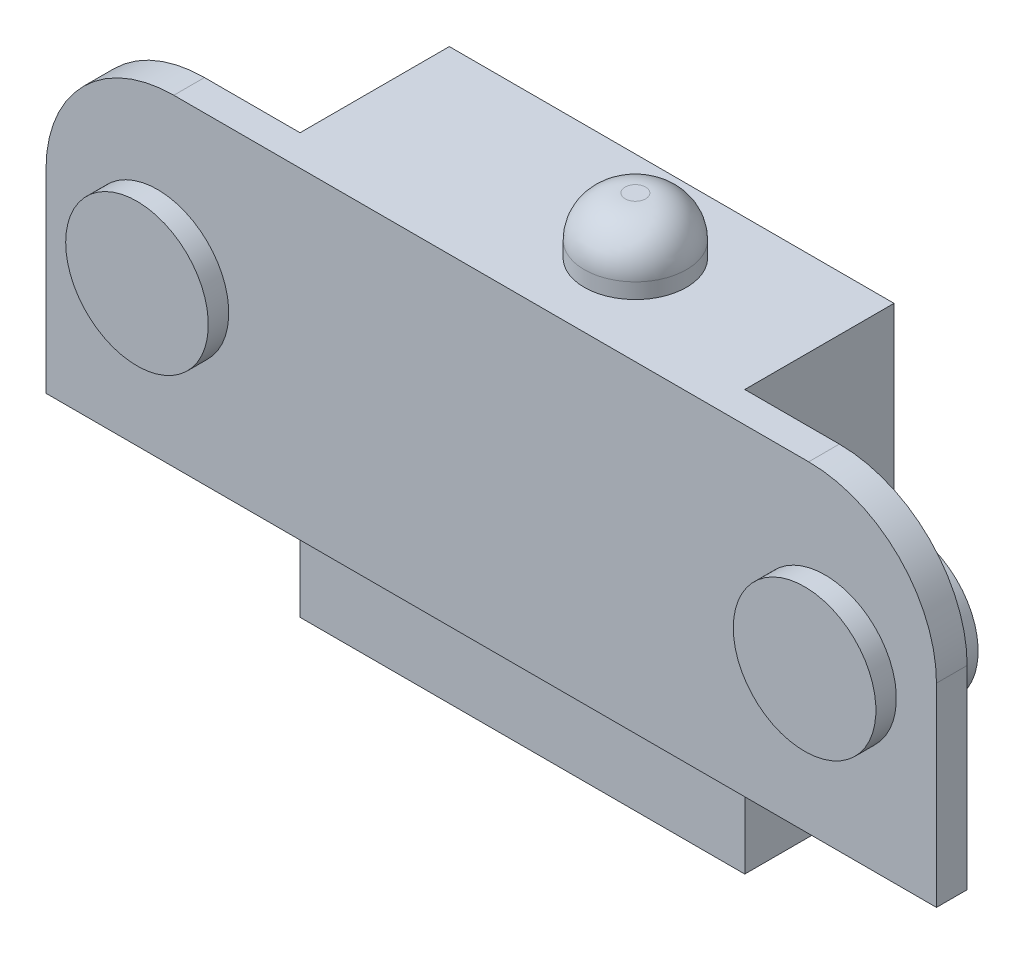
ISO-10303-21;
HEADER;
FILE_DESCRIPTION(('STEP AP214'),'2;1');
FILE_NAME('part.step','',(''),(''),'','','');
FILE_SCHEMA(('AUTOMOTIVE_DESIGN { 1 0 10303 214 1 1 1 1 }'));
ENDSEC;
DATA;
#1=APPLICATION_CONTEXT('core data for automotive mechanical design processes');
#2=APPLICATION_PROTOCOL_DEFINITION('international standard','automotive_design',2000,#1);
#3=PRODUCT_CONTEXT('',#1,'mechanical');
#4=PRODUCT('Part','Part','',(#3));
#5=PRODUCT_RELATED_PRODUCT_CATEGORY('part','',(#4));
#6=PRODUCT_DEFINITION_FORMATION('','',#4);
#7=PRODUCT_DEFINITION_CONTEXT('part definition',#1,'design');
#8=PRODUCT_DEFINITION('design','',#6,#7);
#9=PRODUCT_DEFINITION_SHAPE('','',#8);
#10=(LENGTH_UNIT() NAMED_UNIT(*) SI_UNIT(.MILLI.,.METRE.));
#11=(NAMED_UNIT(*) PLANE_ANGLE_UNIT() SI_UNIT($,.RADIAN.));
#12=(NAMED_UNIT(*) SI_UNIT($,.STERADIAN.) SOLID_ANGLE_UNIT());
#13=UNCERTAINTY_MEASURE_WITH_UNIT(LENGTH_MEASURE(1.E-05),#10,'distance_accuracy_value','');
#14=(GEOMETRIC_REPRESENTATION_CONTEXT(3) GLOBAL_UNCERTAINTY_ASSIGNED_CONTEXT((#13)) GLOBAL_UNIT_ASSIGNED_CONTEXT((#10,
#11,#12)) REPRESENTATION_CONTEXT('',''));
#15=CARTESIAN_POINT('',(0.,0.,0.));
#16=DIRECTION('',(0.,0.,1.));
#17=DIRECTION('',(1.,0.,0.));
#18=AXIS2_PLACEMENT_3D('',#15,#16,#17);
#19=CARTESIAN_POINT('',(24.8158,18.796,-2.9464));
#20=DIRECTION('',(0.,1.,0.));
#21=DIRECTION('',(0.,0.,1.));
#22=AXIS2_PLACEMENT_3D('',#19,#20,#21);
#23=PLANE('',#22);
#24=CARTESIAN_POINT('',(24.8158,18.796,-2.9464));
#25=DIRECTION('',(0.,-1.,0.));
#26=DIRECTION('',(0.,0.,-1.));
#27=AXIS2_PLACEMENT_3D('',#24,#25,#26);
#28=CIRCLE('',#27,0.507999999999998);
#29=CARTESIAN_POINT('',(24.8158,18.796,-3.4544));
#30=VERTEX_POINT('',#29);
#31=EDGE_CURVE('E19',#30,#30,#28,.T.);
#32=ORIENTED_EDGE('',*,*,#31,.F.);
#33=EDGE_LOOP('',(#32));
#34=FACE_BOUND('',#33,.T.);
#35=ADVANCED_FACE('F16',(#34),#23,.T.);
#36=CARTESIAN_POINT('',(5.5372,8.001,-2.54));
#37=DIRECTION('',(0.,0.,1.));
#38=DIRECTION('',(1.,0.,0.));
#39=AXIS2_PLACEMENT_3D('',#36,#37,#38);
#40=PLANE('',#39);
#41=CARTESIAN_POINT('',(5.5372,8.001,-2.54));
#42=DIRECTION('',(0.,0.,-1.));
#43=DIRECTION('',(-1.,0.,0.));
#44=AXIS2_PLACEMENT_3D('',#41,#42,#43);
#45=CIRCLE('',#44,3.5433);
#46=CARTESIAN_POINT('',(1.9939,8.001,-2.54));
#47=VERTEX_POINT('',#46);
#48=EDGE_CURVE('E246',#47,#47,#45,.F.);
#49=ORIENTED_EDGE('',*,*,#48,.F.);
#50=EDGE_LOOP('',(#49));
#51=FACE_BOUND('',#50,.T.);
#52=ADVANCED_FACE('F256',(#51),#40,.F.);
#53=CARTESIAN_POINT('',(38.7096,8.001,-2.54));
#54=DIRECTION('',(0.,0.,1.));
#55=DIRECTION('',(1.,0.,0.));
#56=AXIS2_PLACEMENT_3D('',#53,#54,#55);
#57=PLANE('',#56);
#58=CARTESIAN_POINT('',(38.7096,8.001,-2.54));
#59=DIRECTION('',(0.,0.,-1.));
#60=DIRECTION('',(-1.,0.,0.));
#61=AXIS2_PLACEMENT_3D('',#58,#59,#60);
#62=CIRCLE('',#61,3.5433);
#63=CARTESIAN_POINT('',(35.1663,8.001,-2.54));
#64=VERTEX_POINT('',#63);
#65=EDGE_CURVE('E209',#64,#64,#62,.F.);
#66=ORIENTED_EDGE('',*,*,#65,.F.);
#67=EDGE_LOOP('',(#66));
#68=FACE_BOUND('',#67,.T.);
#69=ADVANCED_FACE('F261',(#68),#57,.F.);
#70=CARTESIAN_POINT('',(24.8158,16.764,-2.9464));
#71=DIRECTION('',(0.,-1.,0.));
#72=DIRECTION('',(1.,0.,0.));
#73=AXIS2_PLACEMENT_3D('',#70,#71,#72);
#74=DEGENERATE_TOROIDAL_SURFACE('',#73,0.508000000000002,2.032,.T.);
#75=CARTESIAN_POINT('',(24.8158,16.764,-2.9464));
#76=DIRECTION('',(0.,1.,0.));
#77=DIRECTION('',(0.,0.,1.));
#78=AXIS2_PLACEMENT_3D('',#75,#76,#77);
#79=CIRCLE('',#78,2.54);
#80=CARTESIAN_POINT('',(24.8158,16.764,-0.4064));
#81=VERTEX_POINT('',#80);
#82=EDGE_CURVE('E206',#81,#81,#79,.F.);
#83=ORIENTED_EDGE('',*,*,#82,.F.);
#84=EDGE_LOOP('',(#83));
#85=FACE_BOUND('',#84,.T.);
#86=ORIENTED_EDGE('',*,*,#31,.T.);
#87=EDGE_LOOP('',(#86));
#88=FACE_BOUND('',#87,.T.);
#89=ADVANCED_FACE('F253',(#85,#88),#74,.T.);
#90=CARTESIAN_POINT('',(5.5372,8.001,2.54));
#91=DIRECTION('',(0.,0.,-1.));
#92=DIRECTION('',(-1.,0.,0.));
#93=AXIS2_PLACEMENT_3D('',#90,#91,#92);
#94=CYLINDRICAL_SURFACE('',#93,3.5433);
#95=ORIENTED_EDGE('',*,*,#48,.T.);
#96=EDGE_LOOP('',(#95));
#97=FACE_BOUND('',#96,.T.);
#98=CARTESIAN_POINT('',(5.5372,8.001,0.));
#99=DIRECTION('',(0.,0.,-1.));
#100=DIRECTION('',(-1.,0.,0.));
#101=AXIS2_PLACEMENT_3D('',#98,#99,#100);
#102=CIRCLE('',#101,3.5433);
#103=CARTESIAN_POINT('',(1.9939,8.001,0.));
#104=VERTEX_POINT('',#103);
#105=EDGE_CURVE('E154',#104,#104,#102,.T.);
#106=ORIENTED_EDGE('',*,*,#105,.T.);
#107=EDGE_LOOP('',(#106));
#108=FACE_BOUND('',#107,.T.);
#109=ADVANCED_FACE('F340',(#97,#108),#94,.T.);
#110=CARTESIAN_POINT('',(11.0998,-4.8514,0.));
#111=DIRECTION('',(0.,-1.,0.));
#112=DIRECTION('',(0.,0.,-1.));
#113=AXIS2_PLACEMENT_3D('',#110,#111,#112);
#114=PLANE('',#113);
#115=DIRECTION('',(1.,0.,0.));
#116=VECTOR('',#115,1.);
#117=CARTESIAN_POINT('',(22.1488,-4.8514,0.));
#118=LINE('',#117,#116);
#119=CARTESIAN_POINT('',(11.0998,-4.8514,0.));
#120=VERTEX_POINT('',#119);
#121=CARTESIAN_POINT('',(33.1978,-4.8514,0.));
#122=VERTEX_POINT('',#121);
#123=EDGE_CURVE('E148',#120,#122,#118,.T.);
#124=ORIENTED_EDGE('',*,*,#123,.F.);
#125=DIRECTION('',(0.,0.,1.));
#126=VECTOR('',#125,1.);
#127=CARTESIAN_POINT('',(11.0998,-4.8514,0.));
#128=LINE('',#127,#126);
#129=CARTESIAN_POINT('',(11.0998,-4.8514,-7.4168));
#130=VERTEX_POINT('',#129);
#131=EDGE_CURVE('E164',#130,#120,#128,.T.);
#132=ORIENTED_EDGE('',*,*,#131,.F.);
#133=DIRECTION('',(1.,0.,0.));
#134=VECTOR('',#133,1.);
#135=CARTESIAN_POINT('',(22.1488,-4.8514,-7.4168));
#136=LINE('',#135,#134);
#137=CARTESIAN_POINT('',(33.1978,-4.8514,-7.4168));
#138=VERTEX_POINT('',#137);
#139=EDGE_CURVE('E186',#130,#138,#136,.T.);
#140=ORIENTED_EDGE('',*,*,#139,.T.);
#141=DIRECTION('',(0.,0.,-1.));
#142=VECTOR('',#141,1.);
#143=CARTESIAN_POINT('',(33.1978,-4.8514,0.));
#144=LINE('',#143,#142);
#145=EDGE_CURVE('E196',#122,#138,#144,.T.);
#146=ORIENTED_EDGE('',*,*,#145,.F.);
#147=EDGE_LOOP('',(#124,#132,#140,#146));
#148=FACE_BOUND('',#147,.T.);
#149=ADVANCED_FACE('F336',(#148),#114,.T.);
#150=CARTESIAN_POINT('',(38.7096,8.001,2.54));
#151=DIRECTION('',(0.,0.,-1.));
#152=DIRECTION('',(-1.,0.,0.));
#153=AXIS2_PLACEMENT_3D('',#150,#151,#152);
#154=CYLINDRICAL_SURFACE('',#153,3.5433);
#155=ORIENTED_EDGE('',*,*,#65,.T.);
#156=EDGE_LOOP('',(#155));
#157=FACE_BOUND('',#156,.T.);
#158=CARTESIAN_POINT('',(38.7096,8.001,0.));
#159=DIRECTION('',(0.,0.,-1.));
#160=DIRECTION('',(-1.,0.,0.));
#161=AXIS2_PLACEMENT_3D('',#158,#159,#160);
#162=CIRCLE('',#161,3.5433);
#163=CARTESIAN_POINT('',(35.1663,8.001,0.));
#164=VERTEX_POINT('',#163);
#165=EDGE_CURVE('E108',#164,#164,#162,.T.);
#166=ORIENTED_EDGE('',*,*,#165,.T.);
#167=EDGE_LOOP('',(#166));
#168=FACE_BOUND('',#167,.T.);
#169=ADVANCED_FACE('F332',(#157,#168),#154,.T.);
#170=CARTESIAN_POINT('',(24.8158,16.002,-2.9464));
#171=DIRECTION('',(0.,1.,0.));
#172=DIRECTION('',(0.,0.,1.));
#173=AXIS2_PLACEMENT_3D('',#170,#171,#172);
#174=CYLINDRICAL_SURFACE('',#173,2.54);
#175=ORIENTED_EDGE('',*,*,#82,.T.);
#176=EDGE_LOOP('',(#175));
#177=FACE_BOUND('',#176,.T.);
#178=CARTESIAN_POINT('',(24.8158,16.002,-2.9464));
#179=DIRECTION('',(0.,1.,0.));
#180=DIRECTION('',(0.,0.,1.));
#181=AXIS2_PLACEMENT_3D('',#178,#179,#180);
#182=CIRCLE('',#181,2.54);
#183=CARTESIAN_POINT('',(24.8158,16.002,-0.4064));
#184=VERTEX_POINT('',#183);
#185=EDGE_CURVE('E107',#184,#184,#182,.F.);
#186=ORIENTED_EDGE('',*,*,#185,.F.);
#187=EDGE_LOOP('',(#186));
#188=FACE_BOUND('',#187,.T.);
#189=ADVANCED_FACE('F328',(#177,#188),#174,.T.);
#190=CARTESIAN_POINT('',(33.1978,-4.8514,0.));
#191=DIRECTION('',(1.,0.,0.));
#192=DIRECTION('',(0.,0.,-1.));
#193=AXIS2_PLACEMENT_3D('',#190,#191,#192);
#194=PLANE('',#193);
#195=DIRECTION('',(0.,1.,0.));
#196=VECTOR('',#195,1.);
#197=CARTESIAN_POINT('',(33.1978,5.5753,0.));
#198=LINE('',#197,#196);
#199=CARTESIAN_POINT('',(33.1978,0.,0.));
#200=VERTEX_POINT('',#199);
#201=EDGE_CURVE('E138',#122,#200,#198,.T.);
#202=ORIENTED_EDGE('',*,*,#201,.F.);
#203=ORIENTED_EDGE('',*,*,#145,.T.);
#204=DIRECTION('',(0.,1.,0.));
#205=VECTOR('',#204,1.);
#206=CARTESIAN_POINT('',(33.1978,5.5753,-7.4168));
#207=LINE('',#206,#205);
#208=CARTESIAN_POINT('',(33.1978,16.002,-7.4168));
#209=VERTEX_POINT('',#208);
#210=EDGE_CURVE('E194',#138,#209,#207,.T.);
#211=ORIENTED_EDGE('',*,*,#210,.T.);
#212=DIRECTION('',(0.,0.,1.));
#213=VECTOR('',#212,1.);
#214=CARTESIAN_POINT('',(33.1978,16.002,0.));
#215=LINE('',#214,#213);
#216=CARTESIAN_POINT('',(33.1978,16.002,0.));
#217=VERTEX_POINT('',#216);
#218=EDGE_CURVE('E191',#217,#209,#215,.F.);
#219=ORIENTED_EDGE('',*,*,#218,.F.);
#220=DIRECTION('',(0.,1.,0.));
#221=VECTOR('',#220,1.);
#222=CARTESIAN_POINT('',(33.1978,8.001,0.));
#223=LINE('',#222,#221);
#224=EDGE_CURVE('E136',#217,#200,#223,.F.);
#225=ORIENTED_EDGE('',*,*,#224,.T.);
#226=EDGE_LOOP('',(#202,#203,#211,#219,#225));
#227=FACE_BOUND('',#226,.T.);
#228=ADVANCED_FACE('F324',(#227),#194,.T.);
#229=CARTESIAN_POINT('',(22.1488,5.5753,-7.4168));
#230=DIRECTION('',(0.,0.,1.));
#231=DIRECTION('',(1.,0.,0.));
#232=AXIS2_PLACEMENT_3D('',#229,#230,#231);
#233=PLANE('',#232);
#234=DIRECTION('',(0.,1.,0.));
#235=VECTOR('',#234,1.);
#236=CARTESIAN_POINT('',(11.0998,16.002,-7.4168));
#237=LINE('',#236,#235);
#238=CARTESIAN_POINT('',(11.0998,16.002,-7.4168));
#239=VERTEX_POINT('',#238);
#240=EDGE_CURVE('E183',#239,#130,#237,.F.);
#241=ORIENTED_EDGE('',*,*,#240,.F.);
#242=DIRECTION('',(1.,0.,0.));
#243=VECTOR('',#242,1.);
#244=CARTESIAN_POINT('',(0.,16.002,-7.4168));
#245=LINE('',#244,#243);
#246=EDGE_CURVE('E180',#209,#239,#245,.F.);
#247=ORIENTED_EDGE('',*,*,#246,.F.);
#248=ORIENTED_EDGE('',*,*,#210,.F.);
#249=ORIENTED_EDGE('',*,*,#139,.F.);
#250=EDGE_LOOP('',(#241,#247,#248,#249));
#251=FACE_BOUND('',#250,.T.);
#252=ADVANCED_FACE('F320',(#251),#233,.F.);
#253=CARTESIAN_POINT('',(11.0998,16.002,0.));
#254=DIRECTION('',(-1.,0.,0.));
#255=DIRECTION('',(0.,0.,1.));
#256=AXIS2_PLACEMENT_3D('',#253,#254,#255);
#257=PLANE('',#256);
#258=DIRECTION('',(0.,1.,0.));
#259=VECTOR('',#258,1.);
#260=CARTESIAN_POINT('',(11.0998,8.001,0.));
#261=LINE('',#260,#259);
#262=CARTESIAN_POINT('',(11.0998,0.,0.));
#263=VERTEX_POINT('',#262);
#264=CARTESIAN_POINT('',(11.0998,16.002,0.));
#265=VERTEX_POINT('',#264);
#266=EDGE_CURVE('E162',#263,#265,#261,.T.);
#267=ORIENTED_EDGE('',*,*,#266,.T.);
#268=DIRECTION('',(0.,0.,1.));
#269=VECTOR('',#268,1.);
#270=CARTESIAN_POINT('',(11.0998,16.002,0.));
#271=LINE('',#270,#269);
#272=EDGE_CURVE('E175',#239,#265,#271,.T.);
#273=ORIENTED_EDGE('',*,*,#272,.F.);
#274=ORIENTED_EDGE('',*,*,#240,.T.);
#275=ORIENTED_EDGE('',*,*,#131,.T.);
#276=DIRECTION('',(0.,1.,0.));
#277=VECTOR('',#276,1.);
#278=CARTESIAN_POINT('',(11.0998,5.5753,0.));
#279=LINE('',#278,#277);
#280=EDGE_CURVE('E151',#263,#120,#279,.F.);
#281=ORIENTED_EDGE('',*,*,#280,.F.);
#282=EDGE_LOOP('',(#267,#273,#274,#275,#281));
#283=FACE_BOUND('',#282,.T.);
#284=ADVANCED_FACE('F316',(#283),#257,.T.);
#285=CARTESIAN_POINT('',(22.1234,8.001,0.));
#286=DIRECTION('',(0.,0.,1.));
#287=DIRECTION('',(1.,0.,0.));
#288=AXIS2_PLACEMENT_3D('',#285,#286,#287);
#289=PLANE('',#288);
#290=ORIENTED_EDGE('',*,*,#105,.F.);
#291=EDGE_LOOP('',(#290));
#292=FACE_BOUND('',#291,.T.);
#293=DIRECTION('',(1.,0.,0.));
#294=VECTOR('',#293,1.);
#295=CARTESIAN_POINT('',(0.,16.002,0.));
#296=LINE('',#295,#294);
#297=CARTESIAN_POINT('',(6.35,16.002,0.));
#298=VERTEX_POINT('',#297);
#299=EDGE_CURVE('E172',#265,#298,#296,.F.);
#300=ORIENTED_EDGE('',*,*,#299,.F.);
#301=ORIENTED_EDGE('',*,*,#266,.F.);
#302=DIRECTION('',(1.,0.,0.));
#303=VECTOR('',#302,1.);
#304=CARTESIAN_POINT('',(44.2468,0.,0.));
#305=LINE('',#304,#303);
#306=CARTESIAN_POINT('',(0.,0.,0.));
#307=VERTEX_POINT('',#306);
#308=EDGE_CURVE('E143',#307,#263,#305,.T.);
#309=ORIENTED_EDGE('',*,*,#308,.F.);
#310=DIRECTION('',(0.,1.,0.));
#311=VECTOR('',#310,1.);
#312=CARTESIAN_POINT('',(0.,0.,0.));
#313=LINE('',#312,#311);
#314=CARTESIAN_POINT('',(0.,9.652,0.));
#315=VERTEX_POINT('',#314);
#316=EDGE_CURVE('E167',#315,#307,#313,.F.);
#317=ORIENTED_EDGE('',*,*,#316,.F.);
#318=CARTESIAN_POINT('',(6.35,9.652,0.));
#319=DIRECTION('',(0.,0.,1.));
#320=DIRECTION('',(1.,0.,0.));
#321=AXIS2_PLACEMENT_3D('',#318,#319,#320);
#322=CIRCLE('',#321,6.35);
#323=EDGE_CURVE('E237',#298,#315,#322,.T.);
#324=ORIENTED_EDGE('',*,*,#323,.F.);
#325=EDGE_LOOP('',(#300,#301,#309,#317,#324));
#326=FACE_BOUND('',#325,.T.);
#327=ADVANCED_FACE('F312',(#292,#326),#289,.F.);
#328=CARTESIAN_POINT('',(22.1488,5.5753,0.));
#329=DIRECTION('',(0.,0.,1.));
#330=DIRECTION('',(1.,0.,0.));
#331=AXIS2_PLACEMENT_3D('',#328,#329,#330);
#332=PLANE('',#331);
#333=ORIENTED_EDGE('',*,*,#123,.T.);
#334=ORIENTED_EDGE('',*,*,#201,.T.);
#335=DIRECTION('',(1.,0.,0.));
#336=VECTOR('',#335,1.);
#337=CARTESIAN_POINT('',(44.2468,0.,0.));
#338=LINE('',#337,#336);
#339=EDGE_CURVE('E133',#263,#200,#338,.T.);
#340=ORIENTED_EDGE('',*,*,#339,.F.);
#341=ORIENTED_EDGE('',*,*,#280,.T.);
#342=EDGE_LOOP('',(#333,#334,#340,#341));
#343=FACE_BOUND('',#342,.T.);
#344=ADVANCED_FACE('F308',(#343),#332,.T.);
#345=CARTESIAN_POINT('',(22.1234,8.001,0.));
#346=DIRECTION('',(0.,0.,1.));
#347=DIRECTION('',(1.,0.,0.));
#348=AXIS2_PLACEMENT_3D('',#345,#346,#347);
#349=PLANE('',#348);
#350=ORIENTED_EDGE('',*,*,#165,.F.);
#351=EDGE_LOOP('',(#350));
#352=FACE_BOUND('',#351,.T.);
#353=DIRECTION('',(0.,1.,0.));
#354=VECTOR('',#353,1.);
#355=CARTESIAN_POINT('',(44.2468,16.002,0.));
#356=LINE('',#355,#354);
#357=CARTESIAN_POINT('',(44.2468,0.,0.));
#358=VERTEX_POINT('',#357);
#359=CARTESIAN_POINT('',(44.2468,9.652,0.));
#360=VERTEX_POINT('',#359);
#361=EDGE_CURVE('E102',#358,#360,#356,.T.);
#362=ORIENTED_EDGE('',*,*,#361,.F.);
#363=DIRECTION('',(1.,0.,0.));
#364=VECTOR('',#363,1.);
#365=CARTESIAN_POINT('',(44.2468,0.,0.));
#366=LINE('',#365,#364);
#367=EDGE_CURVE('E117',#200,#358,#366,.T.);
#368=ORIENTED_EDGE('',*,*,#367,.F.);
#369=ORIENTED_EDGE('',*,*,#224,.F.);
#370=DIRECTION('',(1.,0.,0.));
#371=VECTOR('',#370,1.);
#372=CARTESIAN_POINT('',(0.,16.002,0.));
#373=LINE('',#372,#371);
#374=CARTESIAN_POINT('',(37.8968,16.002,0.));
#375=VERTEX_POINT('',#374);
#376=EDGE_CURVE('E104',#375,#217,#373,.F.);
#377=ORIENTED_EDGE('',*,*,#376,.F.);
#378=CARTESIAN_POINT('',(37.8968,9.652,0.));
#379=DIRECTION('',(0.,0.,1.));
#380=DIRECTION('',(1.,0.,0.));
#381=AXIS2_PLACEMENT_3D('',#378,#379,#380);
#382=CIRCLE('',#381,6.35);
#383=EDGE_CURVE('E97',#360,#375,#382,.T.);
#384=ORIENTED_EDGE('',*,*,#383,.F.);
#385=EDGE_LOOP('',(#362,#368,#369,#377,#384));
#386=FACE_BOUND('',#385,.T.);
#387=ADVANCED_FACE('F99',(#352,#386),#349,.F.);
#388=CARTESIAN_POINT('',(38.7096,8.001,2.54));
#389=DIRECTION('',(0.,0.,1.));
#390=DIRECTION('',(1.,0.,0.));
#391=AXIS2_PLACEMENT_3D('',#388,#389,#390);
#392=PLANE('',#391);
#393=CARTESIAN_POINT('',(38.7096,8.001,2.54));
#394=DIRECTION('',(0.,0.,-1.));
#395=DIRECTION('',(-1.,0.,0.));
#396=AXIS2_PLACEMENT_3D('',#393,#394,#395);
#397=CIRCLE('',#396,3.5433);
#398=CARTESIAN_POINT('',(35.1663,8.001,2.54));
#399=VERTEX_POINT('',#398);
#400=EDGE_CURVE('E120',#399,#399,#397,.T.);
#401=ORIENTED_EDGE('',*,*,#400,.F.);
#402=EDGE_LOOP('',(#401));
#403=FACE_BOUND('',#402,.T.);
#404=ADVANCED_FACE('F301',(#403),#392,.T.);
#405=CARTESIAN_POINT('',(5.5372,8.001,2.54));
#406=DIRECTION('',(0.,0.,1.));
#407=DIRECTION('',(1.,0.,0.));
#408=AXIS2_PLACEMENT_3D('',#405,#406,#407);
#409=PLANE('',#408);
#410=CARTESIAN_POINT('',(5.5372,8.001,2.54));
#411=DIRECTION('',(0.,0.,-1.));
#412=DIRECTION('',(-1.,0.,0.));
#413=AXIS2_PLACEMENT_3D('',#410,#411,#412);
#414=CIRCLE('',#413,3.5433);
#415=CARTESIAN_POINT('',(1.9939,8.001,2.54));
#416=VERTEX_POINT('',#415);
#417=EDGE_CURVE('E123',#416,#416,#414,.T.);
#418=ORIENTED_EDGE('',*,*,#417,.F.);
#419=EDGE_LOOP('',(#418));
#420=FACE_BOUND('',#419,.T.);
#421=ADVANCED_FACE('F298',(#420),#409,.T.);
#422=CARTESIAN_POINT('',(37.8968,9.652,0.));
#423=DIRECTION('',(0.,0.,1.));
#424=DIRECTION('',(1.,0.,0.));
#425=AXIS2_PLACEMENT_3D('',#422,#423,#424);
#426=CYLINDRICAL_SURFACE('',#425,6.35);
#427=ORIENTED_EDGE('',*,*,#383,.T.);
#428=DIRECTION('',(0.,0.,1.));
#429=VECTOR('',#428,1.);
#430=CARTESIAN_POINT('',(37.8968,16.002,0.));
#431=LINE('',#430,#429);
#432=CARTESIAN_POINT('',(37.8968,16.002,1.524));
#433=VERTEX_POINT('',#432);
#434=EDGE_CURVE('E128',#433,#375,#431,.F.);
#435=ORIENTED_EDGE('',*,*,#434,.F.);
#436=CARTESIAN_POINT('',(37.8968,9.652,1.524));
#437=DIRECTION('',(0.,0.,1.));
#438=DIRECTION('',(1.,0.,0.));
#439=AXIS2_PLACEMENT_3D('',#436,#437,#438);
#440=CIRCLE('',#439,6.35);
#441=CARTESIAN_POINT('',(44.2468,9.652,1.524));
#442=VERTEX_POINT('',#441);
#443=EDGE_CURVE('E114',#442,#433,#440,.T.);
#444=ORIENTED_EDGE('',*,*,#443,.F.);
#445=DIRECTION('',(0.,0.,-1.));
#446=VECTOR('',#445,1.);
#447=CARTESIAN_POINT('',(44.2468,9.652,0.));
#448=LINE('',#447,#446);
#449=EDGE_CURVE('E111',#360,#442,#448,.F.);
#450=ORIENTED_EDGE('',*,*,#449,.F.);
#451=EDGE_LOOP('',(#427,#435,#444,#450));
#452=FACE_BOUND('',#451,.T.);
#453=ADVANCED_FACE('F112',(#452),#426,.T.);
#454=CARTESIAN_POINT('',(0.,16.002,0.));
#455=DIRECTION('',(0.,1.,0.));
#456=DIRECTION('',(0.,0.,1.));
#457=AXIS2_PLACEMENT_3D('',#454,#455,#456);
#458=PLANE('',#457);
#459=DIRECTION('',(0.,0.,1.));
#460=VECTOR('',#459,1.);
#461=CARTESIAN_POINT('',(6.35,16.002,0.));
#462=LINE('',#461,#460);
#463=CARTESIAN_POINT('',(6.35,16.002,1.524));
#464=VERTEX_POINT('',#463);
#465=EDGE_CURVE('E174',#464,#298,#462,.F.);
#466=ORIENTED_EDGE('',*,*,#465,.F.);
#467=DIRECTION('',(1.,0.,0.));
#468=VECTOR('',#467,1.);
#469=CARTESIAN_POINT('',(22.1234,16.002,1.524));
#470=LINE('',#469,#468);
#471=EDGE_CURVE('E233',#433,#464,#470,.F.);
#472=ORIENTED_EDGE('',*,*,#471,.F.);
#473=ORIENTED_EDGE('',*,*,#434,.T.);
#474=ORIENTED_EDGE('',*,*,#376,.T.);
#475=ORIENTED_EDGE('',*,*,#218,.T.);
#476=ORIENTED_EDGE('',*,*,#246,.T.);
#477=ORIENTED_EDGE('',*,*,#272,.T.);
#478=ORIENTED_EDGE('',*,*,#299,.T.);
#479=EDGE_LOOP('',(#466,#472,#473,#474,#475,#476,#477,#478));
#480=FACE_BOUND('',#479,.T.);
#481=ORIENTED_EDGE('',*,*,#185,.T.);
#482=EDGE_LOOP('',(#481));
#483=FACE_BOUND('',#482,.T.);
#484=ADVANCED_FACE('F291',(#480,#483),#458,.T.);
#485=CARTESIAN_POINT('',(6.35,9.652,0.));
#486=DIRECTION('',(0.,0.,1.));
#487=DIRECTION('',(1.,0.,0.));
#488=AXIS2_PLACEMENT_3D('',#485,#486,#487);
#489=CYLINDRICAL_SURFACE('',#488,6.35);
#490=ORIENTED_EDGE('',*,*,#323,.T.);
#491=DIRECTION('',(0.,0.,1.));
#492=VECTOR('',#491,1.);
#493=CARTESIAN_POINT('',(0.,9.652,0.));
#494=LINE('',#493,#492);
#495=CARTESIAN_POINT('',(0.,9.652,1.524));
#496=VERTEX_POINT('',#495);
#497=EDGE_CURVE('E169',#496,#315,#494,.F.);
#498=ORIENTED_EDGE('',*,*,#497,.F.);
#499=CARTESIAN_POINT('',(6.35,9.652,1.524));
#500=DIRECTION('',(0.,0.,1.));
#501=DIRECTION('',(1.,0.,0.));
#502=AXIS2_PLACEMENT_3D('',#499,#500,#501);
#503=CIRCLE('',#502,6.35);
#504=EDGE_CURVE('E229',#464,#496,#503,.T.);
#505=ORIENTED_EDGE('',*,*,#504,.F.);
#506=ORIENTED_EDGE('',*,*,#465,.T.);
#507=EDGE_LOOP('',(#490,#498,#505,#506));
#508=FACE_BOUND('',#507,.T.);
#509=ADVANCED_FACE('F287',(#508),#489,.T.);
#510=CARTESIAN_POINT('',(0.,0.,0.));
#511=DIRECTION('',(-1.,0.,0.));
#512=DIRECTION('',(0.,0.,1.));
#513=AXIS2_PLACEMENT_3D('',#510,#511,#512);
#514=PLANE('',#513);
#515=DIRECTION('',(0.,0.,-1.));
#516=VECTOR('',#515,1.);
#517=CARTESIAN_POINT('',(0.,0.,0.));
#518=LINE('',#517,#516);
#519=CARTESIAN_POINT('',(0.,0.,1.524));
#520=VERTEX_POINT('',#519);
#521=EDGE_CURVE('E159',#520,#307,#518,.T.);
#522=ORIENTED_EDGE('',*,*,#521,.F.);
#523=DIRECTION('',(0.,1.,0.));
#524=VECTOR('',#523,1.);
#525=CARTESIAN_POINT('',(0.,8.001,1.524));
#526=LINE('',#525,#524);
#527=EDGE_CURVE('E232',#496,#520,#526,.F.);
#528=ORIENTED_EDGE('',*,*,#527,.F.);
#529=ORIENTED_EDGE('',*,*,#497,.T.);
#530=ORIENTED_EDGE('',*,*,#316,.T.);
#531=EDGE_LOOP('',(#522,#528,#529,#530));
#532=FACE_BOUND('',#531,.T.);
#533=ADVANCED_FACE('F284',(#532),#514,.T.);
#534=CARTESIAN_POINT('',(44.2468,0.,0.));
#535=DIRECTION('',(0.,-1.,0.));
#536=DIRECTION('',(0.,0.,-1.));
#537=AXIS2_PLACEMENT_3D('',#534,#535,#536);
#538=PLANE('',#537);
#539=ORIENTED_EDGE('',*,*,#367,.T.);
#540=DIRECTION('',(0.,0.,-1.));
#541=VECTOR('',#540,1.);
#542=CARTESIAN_POINT('',(44.2468,0.,0.));
#543=LINE('',#542,#541);
#544=CARTESIAN_POINT('',(44.2468,0.,1.524));
#545=VERTEX_POINT('',#544);
#546=EDGE_CURVE('E34',#545,#358,#543,.T.);
#547=ORIENTED_EDGE('',*,*,#546,.F.);
#548=DIRECTION('',(1.,0.,0.));
#549=VECTOR('',#548,1.);
#550=CARTESIAN_POINT('',(22.1234,0.,1.524));
#551=LINE('',#550,#549);
#552=EDGE_CURVE('E538',#520,#545,#551,.T.);
#553=ORIENTED_EDGE('',*,*,#552,.F.);
#554=ORIENTED_EDGE('',*,*,#521,.T.);
#555=ORIENTED_EDGE('',*,*,#308,.T.);
#556=ORIENTED_EDGE('',*,*,#339,.T.);
#557=EDGE_LOOP('',(#539,#547,#553,#554,#555,#556));
#558=FACE_BOUND('',#557,.T.);
#559=ADVANCED_FACE('F281',(#558),#538,.T.);
#560=CARTESIAN_POINT('',(44.2468,16.002,0.));
#561=DIRECTION('',(1.,0.,0.));
#562=DIRECTION('',(0.,0.,-1.));
#563=AXIS2_PLACEMENT_3D('',#560,#561,#562);
#564=PLANE('',#563);
#565=ORIENTED_EDGE('',*,*,#546,.T.);
#566=ORIENTED_EDGE('',*,*,#361,.T.);
#567=ORIENTED_EDGE('',*,*,#449,.T.);
#568=DIRECTION('',(0.,1.,0.));
#569=VECTOR('',#568,1.);
#570=CARTESIAN_POINT('',(44.2468,8.001,1.524));
#571=LINE('',#570,#569);
#572=EDGE_CURVE('E228',#545,#442,#571,.T.);
#573=ORIENTED_EDGE('',*,*,#572,.F.);
#574=EDGE_LOOP('',(#565,#566,#567,#573));
#575=FACE_BOUND('',#574,.T.);
#576=ADVANCED_FACE('F119',(#575),#564,.T.);
#577=CARTESIAN_POINT('',(38.7096,8.001,2.54));
#578=DIRECTION('',(0.,0.,-1.));
#579=DIRECTION('',(-1.,0.,0.));
#580=AXIS2_PLACEMENT_3D('',#577,#578,#579);
#581=CYLINDRICAL_SURFACE('',#580,3.5433);
#582=CARTESIAN_POINT('',(38.7096,8.001,1.524));
#583=DIRECTION('',(0.,0.,-1.));
#584=DIRECTION('',(-1.,0.,0.));
#585=AXIS2_PLACEMENT_3D('',#582,#583,#584);
#586=CIRCLE('',#585,3.5433);
#587=CARTESIAN_POINT('',(35.1663,8.001,1.524));
#588=VERTEX_POINT('',#587);
#589=EDGE_CURVE('E25',#588,#588,#586,.T.);
#590=ORIENTED_EDGE('',*,*,#589,.F.);
#591=EDGE_LOOP('',(#590));
#592=FACE_BOUND('',#591,.T.);
#593=ORIENTED_EDGE('',*,*,#400,.T.);
#594=EDGE_LOOP('',(#593));
#595=FACE_BOUND('',#594,.T.);
#596=ADVANCED_FACE('F271',(#592,#595),#581,.T.);
#597=CARTESIAN_POINT('',(5.5372,8.001,2.54));
#598=DIRECTION('',(0.,0.,-1.));
#599=DIRECTION('',(-1.,0.,0.));
#600=AXIS2_PLACEMENT_3D('',#597,#598,#599);
#601=CYLINDRICAL_SURFACE('',#600,3.5433);
#602=CARTESIAN_POINT('',(5.5372,8.001,1.524));
#603=DIRECTION('',(0.,0.,-1.));
#604=DIRECTION('',(-1.,0.,0.));
#605=AXIS2_PLACEMENT_3D('',#602,#603,#604);
#606=CIRCLE('',#605,3.5433);
#607=CARTESIAN_POINT('',(1.9939,8.001,1.524));
#608=VERTEX_POINT('',#607);
#609=EDGE_CURVE('E11',#608,#608,#606,.T.);
#610=ORIENTED_EDGE('',*,*,#609,.F.);
#611=EDGE_LOOP('',(#610));
#612=FACE_BOUND('',#611,.T.);
#613=ORIENTED_EDGE('',*,*,#417,.T.);
#614=EDGE_LOOP('',(#613));
#615=FACE_BOUND('',#614,.T.);
#616=ADVANCED_FACE('F265',(#612,#615),#601,.T.);
#617=CARTESIAN_POINT('',(22.1234,8.001,1.524));
#618=DIRECTION('',(0.,0.,1.));
#619=DIRECTION('',(1.,0.,0.));
#620=AXIS2_PLACEMENT_3D('',#617,#618,#619);
#621=PLANE('',#620);
#622=ORIENTED_EDGE('',*,*,#609,.T.);
#623=EDGE_LOOP('',(#622));
#624=FACE_BOUND('',#623,.T.);
#625=ORIENTED_EDGE('',*,*,#589,.T.);
#626=EDGE_LOOP('',(#625));
#627=FACE_BOUND('',#626,.T.);
#628=ORIENTED_EDGE('',*,*,#552,.T.);
#629=ORIENTED_EDGE('',*,*,#572,.T.);
#630=ORIENTED_EDGE('',*,*,#443,.T.);
#631=ORIENTED_EDGE('',*,*,#471,.T.);
#632=ORIENTED_EDGE('',*,*,#504,.T.);
#633=ORIENTED_EDGE('',*,*,#527,.T.);
#634=EDGE_LOOP('',(#628,#629,#630,#631,#632,#633));
#635=FACE_BOUND('',#634,.T.);
#636=ADVANCED_FACE('F263',(#624,#627,#635),#621,.T.);
#637=CLOSED_SHELL('',(#35,#52,#69,#89,#109,#149,#169,#189,#228,#252,#284,#327,#344,#387,#404,
#421,#453,#484,#509,#533,#559,#576,#596,#616,#636));
#638=MANIFOLD_SOLID_BREP('B1',#637);
#639=ADVANCED_BREP_SHAPE_REPRESENTATION('',(#18,#638),#14);
#640=SHAPE_DEFINITION_REPRESENTATION(#9,#639);
ENDSEC;
END-ISO-10303-21;
